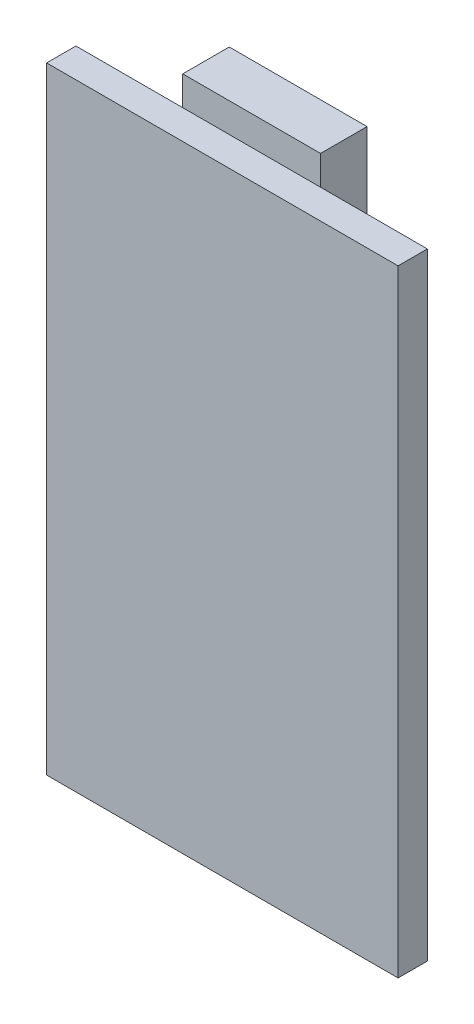
ISO-10303-21;
HEADER;
FILE_DESCRIPTION(('STEP AP214'),'2;1');
FILE_NAME('part.step','',(''),(''),'','','');
FILE_SCHEMA(('AUTOMOTIVE_DESIGN { 1 0 10303 214 1 1 1 1 }'));
ENDSEC;
DATA;
#1=APPLICATION_CONTEXT('core data for automotive mechanical design processes');
#2=APPLICATION_PROTOCOL_DEFINITION('international standard','automotive_design',2000,#1);
#3=PRODUCT_CONTEXT('',#1,'mechanical');
#4=PRODUCT('Part','Part','',(#3));
#5=PRODUCT_RELATED_PRODUCT_CATEGORY('part','',(#4));
#6=PRODUCT_DEFINITION_FORMATION('','',#4);
#7=PRODUCT_DEFINITION_CONTEXT('part definition',#1,'design');
#8=PRODUCT_DEFINITION('design','',#6,#7);
#9=PRODUCT_DEFINITION_SHAPE('','',#8);
#10=(LENGTH_UNIT() NAMED_UNIT(*) SI_UNIT(.MILLI.,.METRE.));
#11=(NAMED_UNIT(*) PLANE_ANGLE_UNIT() SI_UNIT($,.RADIAN.));
#12=(NAMED_UNIT(*) SI_UNIT($,.STERADIAN.) SOLID_ANGLE_UNIT());
#13=UNCERTAINTY_MEASURE_WITH_UNIT(LENGTH_MEASURE(1.E-05),#10,'distance_accuracy_value','');
#14=(GEOMETRIC_REPRESENTATION_CONTEXT(3) GLOBAL_UNCERTAINTY_ASSIGNED_CONTEXT((#13)) GLOBAL_UNIT_ASSIGNED_CONTEXT((#10,
#11,#12)) REPRESENTATION_CONTEXT('',''));
#15=CARTESIAN_POINT('',(0.,0.,0.));
#16=DIRECTION('',(0.,0.,1.));
#17=DIRECTION('',(1.,0.,0.));
#18=AXIS2_PLACEMENT_3D('',#15,#16,#17);
#19=CARTESIAN_POINT('',(-10.2,-35.8,-1.7));
#20=DIRECTION('',(0.,0.,1.));
#21=DIRECTION('',(1.,0.,0.));
#22=AXIS2_PLACEMENT_3D('',#19,#20,#21);
#23=PLANE('',#22);
#24=DIRECTION('',(0.,-1.,0.));
#25=VECTOR('',#24,1.);
#26=CARTESIAN_POINT('',(4.,1.7,-1.7));
#27=LINE('',#26,#25);
#28=CARTESIAN_POINT('',(4.,0.,-1.7));
#29=VERTEX_POINT('',#28);
#30=CARTESIAN_POINT('',(4.,-4.1,-1.7));
#31=VERTEX_POINT('',#30);
#32=EDGE_CURVE('E11',#29,#31,#27,.T.);
#33=ORIENTED_EDGE('',*,*,#32,.F.);
#34=DIRECTION('',(-1.,0.,0.));
#35=VECTOR('',#34,1.);
#36=CARTESIAN_POINT('',(-10.2,0.,-1.7));
#37=LINE('',#36,#35);
#38=CARTESIAN_POINT('',(10.2,0.,-1.7));
#39=VERTEX_POINT('',#38);
#40=EDGE_CURVE('E144',#39,#29,#37,.T.);
#41=ORIENTED_EDGE('',*,*,#40,.F.);
#42=DIRECTION('',(0.,1.,0.));
#43=VECTOR('',#42,1.);
#44=CARTESIAN_POINT('',(10.2,0.,-1.7));
#45=LINE('',#44,#43);
#46=CARTESIAN_POINT('',(10.2,-35.8,-1.7));
#47=VERTEX_POINT('',#46);
#48=EDGE_CURVE('E141',#47,#39,#45,.T.);
#49=ORIENTED_EDGE('',*,*,#48,.F.);
#50=DIRECTION('',(1.,0.,0.));
#51=VECTOR('',#50,1.);
#52=CARTESIAN_POINT('',(-10.2,-35.8,-1.7));
#53=LINE('',#52,#51);
#54=CARTESIAN_POINT('',(-10.2,-35.8,-1.7));
#55=VERTEX_POINT('',#54);
#56=EDGE_CURVE('E137',#55,#47,#53,.T.);
#57=ORIENTED_EDGE('',*,*,#56,.F.);
#58=DIRECTION('',(0.,-1.,0.));
#59=VECTOR('',#58,1.);
#60=CARTESIAN_POINT('',(-10.2,0.,-1.7));
#61=LINE('',#60,#59);
#62=CARTESIAN_POINT('',(-10.2,0.,-1.7));
#63=VERTEX_POINT('',#62);
#64=EDGE_CURVE('E134',#63,#55,#61,.T.);
#65=ORIENTED_EDGE('',*,*,#64,.F.);
#66=CARTESIAN_POINT('',(-4.,0.,-1.7));
#67=VERTEX_POINT('',#66);
#68=EDGE_CURVE('E53',#67,#63,#37,.T.);
#69=ORIENTED_EDGE('',*,*,#68,.F.);
#70=DIRECTION('',(0.,1.,0.));
#71=VECTOR('',#70,1.);
#72=CARTESIAN_POINT('',(-4.,1.7,-1.7));
#73=LINE('',#72,#71);
#74=CARTESIAN_POINT('',(-4.,-4.1,-1.7));
#75=VERTEX_POINT('',#74);
#76=EDGE_CURVE('E286',#75,#67,#73,.T.);
#77=ORIENTED_EDGE('',*,*,#76,.F.);
#78=DIRECTION('',(-1.,0.,0.));
#79=VECTOR('',#78,1.);
#80=CARTESIAN_POINT('',(4.,-4.1,-1.7));
#81=LINE('',#80,#79);
#82=EDGE_CURVE('E48',#31,#75,#81,.T.);
#83=ORIENTED_EDGE('',*,*,#82,.F.);
#84=EDGE_LOOP('',(#33,#41,#49,#57,#65,#69,#77,#83));
#85=FACE_BOUND('',#84,.T.);
#86=ADVANCED_FACE('F30',(#85),#23,.F.);
#87=CARTESIAN_POINT('',(-10.2,0.,-1.7));
#88=DIRECTION('',(-1.,0.,0.));
#89=DIRECTION('',(0.,-1.,0.));
#90=AXIS2_PLACEMENT_3D('',#87,#88,#89);
#91=PLANE('',#90);
#92=DIRECTION('',(0.,-1.,0.));
#93=VECTOR('',#92,1.);
#94=CARTESIAN_POINT('',(-10.2,0.,0.));
#95=LINE('',#94,#93);
#96=CARTESIAN_POINT('',(-10.2,0.,0.));
#97=VERTEX_POINT('',#96);
#98=CARTESIAN_POINT('',(-10.2,-35.8,0.));
#99=VERTEX_POINT('',#98);
#100=EDGE_CURVE('E125',#97,#99,#95,.T.);
#101=ORIENTED_EDGE('',*,*,#100,.F.);
#102=DIRECTION('',(0.,0.,1.));
#103=VECTOR('',#102,1.);
#104=CARTESIAN_POINT('',(-10.2,0.,-1.7));
#105=LINE('',#104,#103);
#106=EDGE_CURVE('E39',#63,#97,#105,.T.);
#107=ORIENTED_EDGE('',*,*,#106,.F.);
#108=ORIENTED_EDGE('',*,*,#64,.T.);
#109=DIRECTION('',(0.,0.,1.));
#110=VECTOR('',#109,1.);
#111=CARTESIAN_POINT('',(-10.2,-35.8,-1.7));
#112=LINE('',#111,#110);
#113=EDGE_CURVE('E34',#55,#99,#112,.T.);
#114=ORIENTED_EDGE('',*,*,#113,.T.);
#115=EDGE_LOOP('',(#101,#107,#108,#114));
#116=FACE_BOUND('',#115,.T.);
#117=ADVANCED_FACE('F32',(#116),#91,.T.);
#118=CARTESIAN_POINT('',(-10.2,0.,-1.7));
#119=DIRECTION('',(0.,1.,0.));
#120=DIRECTION('',(0.,0.,1.));
#121=AXIS2_PLACEMENT_3D('',#118,#119,#120);
#122=PLANE('',#121);
#123=DIRECTION('',(-1.,0.,0.));
#124=VECTOR('',#123,1.);
#125=CARTESIAN_POINT('',(-10.2,0.,0.));
#126=LINE('',#125,#124);
#127=CARTESIAN_POINT('',(10.2,0.,0.));
#128=VERTEX_POINT('',#127);
#129=EDGE_CURVE('E138',#128,#97,#126,.T.);
#130=ORIENTED_EDGE('',*,*,#129,.F.);
#131=DIRECTION('',(0.,0.,1.));
#132=VECTOR('',#131,1.);
#133=CARTESIAN_POINT('',(10.2,0.,-1.7));
#134=LINE('',#133,#132);
#135=EDGE_CURVE('E156',#39,#128,#134,.T.);
#136=ORIENTED_EDGE('',*,*,#135,.F.);
#137=ORIENTED_EDGE('',*,*,#40,.T.);
#138=EDGE_CURVE('E146',#29,#67,#37,.T.);
#139=ORIENTED_EDGE('',*,*,#138,.T.);
#140=ORIENTED_EDGE('',*,*,#68,.T.);
#141=ORIENTED_EDGE('',*,*,#106,.T.);
#142=EDGE_LOOP('',(#130,#136,#137,#139,#140,#141));
#143=FACE_BOUND('',#142,.T.);
#144=ADVANCED_FACE('F170',(#143),#122,.T.);
#145=CARTESIAN_POINT('',(10.2,0.,-1.7));
#146=DIRECTION('',(1.,0.,0.));
#147=DIRECTION('',(0.,1.,0.));
#148=AXIS2_PLACEMENT_3D('',#145,#146,#147);
#149=PLANE('',#148);
#150=DIRECTION('',(0.,1.,0.));
#151=VECTOR('',#150,1.);
#152=CARTESIAN_POINT('',(10.2,0.,0.));
#153=LINE('',#152,#151);
#154=CARTESIAN_POINT('',(10.2,-35.8,0.));
#155=VERTEX_POINT('',#154);
#156=EDGE_CURVE('E150',#155,#128,#153,.T.);
#157=ORIENTED_EDGE('',*,*,#156,.F.);
#158=DIRECTION('',(0.,0.,1.));
#159=VECTOR('',#158,1.);
#160=CARTESIAN_POINT('',(10.2,-35.8,-1.7));
#161=LINE('',#160,#159);
#162=EDGE_CURVE('E157',#47,#155,#161,.T.);
#163=ORIENTED_EDGE('',*,*,#162,.F.);
#164=ORIENTED_EDGE('',*,*,#48,.T.);
#165=ORIENTED_EDGE('',*,*,#135,.T.);
#166=EDGE_LOOP('',(#157,#163,#164,#165));
#167=FACE_BOUND('',#166,.T.);
#168=ADVANCED_FACE('F174',(#167),#149,.T.);
#169=CARTESIAN_POINT('',(-10.2,-35.8,-1.7));
#170=DIRECTION('',(0.,-1.,0.));
#171=DIRECTION('',(0.,0.,-1.));
#172=AXIS2_PLACEMENT_3D('',#169,#170,#171);
#173=PLANE('',#172);
#174=DIRECTION('',(1.,0.,0.));
#175=VECTOR('',#174,1.);
#176=CARTESIAN_POINT('',(-10.2,-35.8,0.));
#177=LINE('',#176,#175);
#178=EDGE_CURVE('E128',#99,#155,#177,.T.);
#179=ORIENTED_EDGE('',*,*,#178,.F.);
#180=ORIENTED_EDGE('',*,*,#113,.F.);
#181=ORIENTED_EDGE('',*,*,#56,.T.);
#182=ORIENTED_EDGE('',*,*,#162,.T.);
#183=EDGE_LOOP('',(#179,#180,#181,#182));
#184=FACE_BOUND('',#183,.T.);
#185=ADVANCED_FACE('F165',(#184),#173,.T.);
#186=CARTESIAN_POINT('',(-10.2,-35.8,0.));
#187=DIRECTION('',(0.,0.,1.));
#188=DIRECTION('',(1.,0.,0.));
#189=AXIS2_PLACEMENT_3D('',#186,#187,#188);
#190=PLANE('',#189);
#191=ORIENTED_EDGE('',*,*,#100,.T.);
#192=ORIENTED_EDGE('',*,*,#178,.T.);
#193=ORIENTED_EDGE('',*,*,#156,.T.);
#194=ORIENTED_EDGE('',*,*,#129,.T.);
#195=EDGE_LOOP('',(#191,#192,#193,#194));
#196=FACE_BOUND('',#195,.T.);
#197=ADVANCED_FACE('F167',(#196),#190,.T.);
#198=CARTESIAN_POINT('',(4.,1.7,-4.4));
#199=DIRECTION('',(-1.,0.,0.));
#200=DIRECTION('',(0.,-1.,0.));
#201=AXIS2_PLACEMENT_3D('',#198,#199,#200);
#202=PLANE('',#201);
#203=CARTESIAN_POINT('',(4.,1.7,-1.7));
#204=VERTEX_POINT('',#203);
#205=EDGE_CURVE('E41',#204,#29,#27,.T.);
#206=ORIENTED_EDGE('',*,*,#205,.T.);
#207=ORIENTED_EDGE('',*,*,#32,.T.);
#208=DIRECTION('',(0.,0.,1.));
#209=VECTOR('',#208,1.);
#210=CARTESIAN_POINT('',(4.,-4.1,-4.4));
#211=LINE('',#210,#209);
#212=CARTESIAN_POINT('',(4.,-4.1,-4.4));
#213=VERTEX_POINT('',#212);
#214=EDGE_CURVE('E106',#213,#31,#211,.T.);
#215=ORIENTED_EDGE('',*,*,#214,.F.);
#216=DIRECTION('',(0.,-1.,0.));
#217=VECTOR('',#216,1.);
#218=CARTESIAN_POINT('',(4.,1.7,-4.4));
#219=LINE('',#218,#217);
#220=CARTESIAN_POINT('',(4.,1.7,-4.4));
#221=VERTEX_POINT('',#220);
#222=EDGE_CURVE('E112',#221,#213,#219,.T.);
#223=ORIENTED_EDGE('',*,*,#222,.F.);
#224=DIRECTION('',(0.,0.,1.));
#225=VECTOR('',#224,1.);
#226=CARTESIAN_POINT('',(4.,1.7,-4.4));
#227=LINE('',#226,#225);
#228=EDGE_CURVE('E281',#221,#204,#227,.T.);
#229=ORIENTED_EDGE('',*,*,#228,.T.);
#230=EDGE_LOOP('',(#206,#207,#215,#223,#229));
#231=FACE_BOUND('',#230,.T.);
#232=ADVANCED_FACE('F124',(#231),#202,.F.);
#233=CARTESIAN_POINT('',(4.,-4.1,-4.4));
#234=DIRECTION('',(0.,1.,0.));
#235=DIRECTION('',(-1.,0.,0.));
#236=AXIS2_PLACEMENT_3D('',#233,#234,#235);
#237=PLANE('',#236);
#238=ORIENTED_EDGE('',*,*,#82,.T.);
#239=DIRECTION('',(0.,0.,1.));
#240=VECTOR('',#239,1.);
#241=CARTESIAN_POINT('',(-4.,-4.1,-4.4));
#242=LINE('',#241,#240);
#243=CARTESIAN_POINT('',(-4.,-4.1,-4.4));
#244=VERTEX_POINT('',#243);
#245=EDGE_CURVE('E108',#244,#75,#242,.T.);
#246=ORIENTED_EDGE('',*,*,#245,.F.);
#247=DIRECTION('',(-1.,0.,0.));
#248=VECTOR('',#247,1.);
#249=CARTESIAN_POINT('',(4.,-4.1,-4.4));
#250=LINE('',#249,#248);
#251=EDGE_CURVE('E102',#213,#244,#250,.T.);
#252=ORIENTED_EDGE('',*,*,#251,.F.);
#253=ORIENTED_EDGE('',*,*,#214,.T.);
#254=EDGE_LOOP('',(#238,#246,#252,#253));
#255=FACE_BOUND('',#254,.T.);
#256=ADVANCED_FACE('F104',(#255),#237,.F.);
#257=CARTESIAN_POINT('',(-4.,1.7,-4.4));
#258=DIRECTION('',(1.,0.,0.));
#259=DIRECTION('',(0.,1.,0.));
#260=AXIS2_PLACEMENT_3D('',#257,#258,#259);
#261=PLANE('',#260);
#262=ORIENTED_EDGE('',*,*,#76,.T.);
#263=CARTESIAN_POINT('',(-4.,1.7,-1.7));
#264=VERTEX_POINT('',#263);
#265=EDGE_CURVE('E279',#67,#264,#73,.T.);
#266=ORIENTED_EDGE('',*,*,#265,.T.);
#267=DIRECTION('',(0.,0.,1.));
#268=VECTOR('',#267,1.);
#269=CARTESIAN_POINT('',(-4.,1.7,-4.4));
#270=LINE('',#269,#268);
#271=CARTESIAN_POINT('',(-4.,1.7,-4.4));
#272=VERTEX_POINT('',#271);
#273=EDGE_CURVE('E130',#272,#264,#270,.T.);
#274=ORIENTED_EDGE('',*,*,#273,.F.);
#275=DIRECTION('',(0.,1.,0.));
#276=VECTOR('',#275,1.);
#277=CARTESIAN_POINT('',(-4.,1.7,-4.4));
#278=LINE('',#277,#276);
#279=EDGE_CURVE('E111',#244,#272,#278,.T.);
#280=ORIENTED_EDGE('',*,*,#279,.F.);
#281=ORIENTED_EDGE('',*,*,#245,.T.);
#282=EDGE_LOOP('',(#262,#266,#274,#280,#281));
#283=FACE_BOUND('',#282,.T.);
#284=ADVANCED_FACE('F197',(#283),#261,.F.);
#285=CARTESIAN_POINT('',(4.,1.7,-4.4));
#286=DIRECTION('',(0.,-1.,0.));
#287=DIRECTION('',(0.,0.,-1.));
#288=AXIS2_PLACEMENT_3D('',#285,#286,#287);
#289=PLANE('',#288);
#290=DIRECTION('',(1.,0.,0.));
#291=VECTOR('',#290,1.);
#292=CARTESIAN_POINT('',(4.,1.7,-1.7));
#293=LINE('',#292,#291);
#294=EDGE_CURVE('E121',#264,#204,#293,.T.);
#295=ORIENTED_EDGE('',*,*,#294,.T.);
#296=ORIENTED_EDGE('',*,*,#228,.F.);
#297=DIRECTION('',(1.,0.,0.));
#298=VECTOR('',#297,1.);
#299=CARTESIAN_POINT('',(4.,1.7,-4.4));
#300=LINE('',#299,#298);
#301=EDGE_CURVE('E117',#272,#221,#300,.T.);
#302=ORIENTED_EDGE('',*,*,#301,.F.);
#303=ORIENTED_EDGE('',*,*,#273,.T.);
#304=EDGE_LOOP('',(#295,#296,#302,#303));
#305=FACE_BOUND('',#304,.T.);
#306=ADVANCED_FACE('F201',(#305),#289,.F.);
#307=CARTESIAN_POINT('',(4.,-4.1,-4.4));
#308=DIRECTION('',(0.,0.,-1.));
#309=DIRECTION('',(-1.,0.,0.));
#310=AXIS2_PLACEMENT_3D('',#307,#308,#309);
#311=PLANE('',#310);
#312=ORIENTED_EDGE('',*,*,#222,.T.);
#313=ORIENTED_EDGE('',*,*,#251,.T.);
#314=ORIENTED_EDGE('',*,*,#279,.T.);
#315=ORIENTED_EDGE('',*,*,#301,.T.);
#316=EDGE_LOOP('',(#312,#313,#314,#315));
#317=FACE_BOUND('',#316,.T.);
#318=ADVANCED_FACE('F115',(#317),#311,.T.);
#319=CARTESIAN_POINT('',(4.,-4.1,-1.7));
#320=DIRECTION('',(0.,0.,-1.));
#321=DIRECTION('',(-1.,0.,0.));
#322=AXIS2_PLACEMENT_3D('',#319,#320,#321);
#323=PLANE('',#322);
#324=ORIENTED_EDGE('',*,*,#138,.F.);
#325=ORIENTED_EDGE('',*,*,#205,.F.);
#326=ORIENTED_EDGE('',*,*,#294,.F.);
#327=ORIENTED_EDGE('',*,*,#265,.F.);
#328=EDGE_LOOP('',(#324,#325,#326,#327));
#329=FACE_BOUND('',#328,.T.);
#330=ADVANCED_FACE('F208',(#329),#323,.F.);
#331=CLOSED_SHELL('',(#86,#117,#144,#168,#185,#197,#232,#256,#284,#306,#318,#330));
#332=MANIFOLD_SOLID_BREP('B2',#331);
#333=ADVANCED_BREP_SHAPE_REPRESENTATION('',(#18,#332),#14);
#334=SHAPE_DEFINITION_REPRESENTATION(#9,#333);
ENDSEC;
END-ISO-10303-21;
